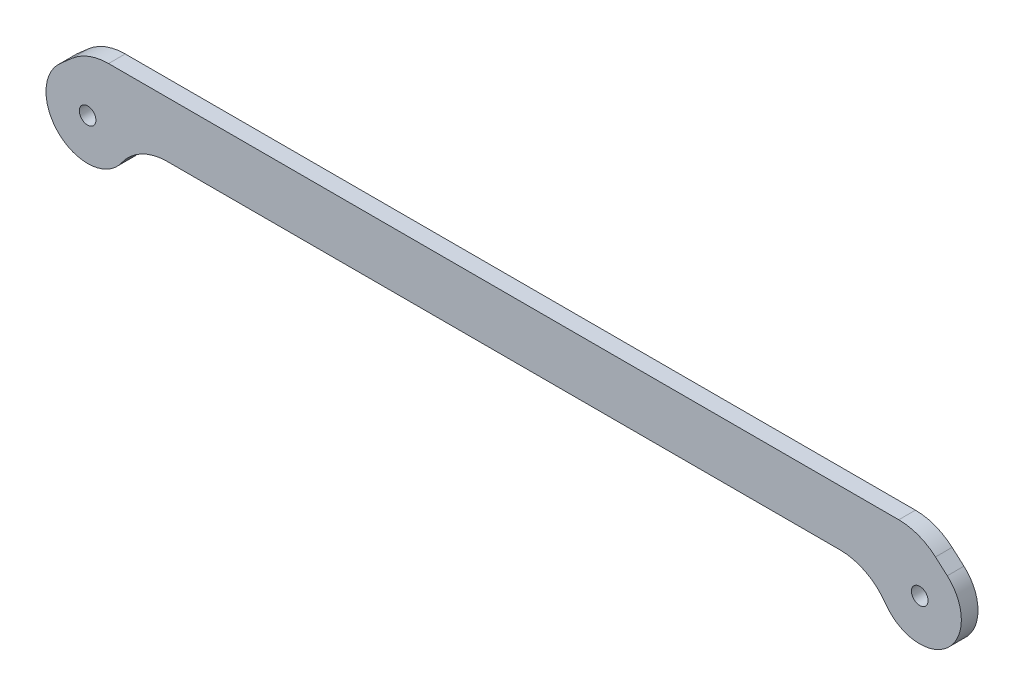
ISO-10303-21;
HEADER;
FILE_DESCRIPTION(('STEP AP214'),'2;1');
FILE_NAME('part.step','',(''),(''),'','','');
FILE_SCHEMA(('AUTOMOTIVE_DESIGN { 1 0 10303 214 1 1 1 1 }'));
ENDSEC;
DATA;
#1=APPLICATION_CONTEXT('core data for automotive mechanical design processes');
#2=APPLICATION_PROTOCOL_DEFINITION('international standard','automotive_design',2000,#1);
#3=PRODUCT_CONTEXT('',#1,'mechanical');
#4=PRODUCT('Part','Part','',(#3));
#5=PRODUCT_RELATED_PRODUCT_CATEGORY('part','',(#4));
#6=PRODUCT_DEFINITION_FORMATION('','',#4);
#7=PRODUCT_DEFINITION_CONTEXT('part definition',#1,'design');
#8=PRODUCT_DEFINITION('design','',#6,#7);
#9=PRODUCT_DEFINITION_SHAPE('','',#8);
#10=(LENGTH_UNIT() NAMED_UNIT(*) SI_UNIT(.MILLI.,.METRE.));
#11=(NAMED_UNIT(*) PLANE_ANGLE_UNIT() SI_UNIT($,.RADIAN.));
#12=(NAMED_UNIT(*) SI_UNIT($,.STERADIAN.) SOLID_ANGLE_UNIT());
#13=UNCERTAINTY_MEASURE_WITH_UNIT(LENGTH_MEASURE(1.E-05),#10,'distance_accuracy_value','');
#14=(GEOMETRIC_REPRESENTATION_CONTEXT(3) GLOBAL_UNCERTAINTY_ASSIGNED_CONTEXT((#13)) GLOBAL_UNIT_ASSIGNED_CONTEXT((#10,
#11,#12)) REPRESENTATION_CONTEXT('',''));
#15=CARTESIAN_POINT('',(0.,0.,0.));
#16=DIRECTION('',(0.,0.,1.));
#17=DIRECTION('',(1.,0.,0.));
#18=AXIS2_PLACEMENT_3D('',#15,#16,#17);
#19=CARTESIAN_POINT('',(0.,0.,3.));
#20=DIRECTION('',(0.,1.,0.));
#21=DIRECTION('',(0.,0.,1.));
#22=AXIS2_PLACEMENT_3D('',#19,#20,#21);
#23=PLANE('',#22);
#24=DIRECTION('',(1.,0.,0.));
#25=VECTOR('',#24,1.);
#26=CARTESIAN_POINT('',(0.,0.,3.));
#27=LINE('',#26,#25);
#28=CARTESIAN_POINT('',(14.3614066163451,0.,3.));
#29=VERTEX_POINT('',#28);
#30=CARTESIAN_POINT('',(135.638593383655,0.,3.));
#31=VERTEX_POINT('',#30);
#32=EDGE_CURVE('E130',#29,#31,#27,.T.);
#33=ORIENTED_EDGE('',*,*,#32,.F.);
#34=DIRECTION('',(0.,0.,1.));
#35=VECTOR('',#34,1.);
#36=CARTESIAN_POINT('',(14.3614066163451,0.,0.));
#37=LINE('',#36,#35);
#38=CARTESIAN_POINT('',(14.3614066163451,0.,0.));
#39=VERTEX_POINT('',#38);
#40=EDGE_CURVE('E199',#29,#39,#37,.F.);
#41=ORIENTED_EDGE('',*,*,#40,.T.);
#42=DIRECTION('',(1.,0.,0.));
#43=VECTOR('',#42,1.);
#44=CARTESIAN_POINT('',(0.,0.,0.));
#45=LINE('',#44,#43);
#46=CARTESIAN_POINT('',(135.638593383655,0.,0.));
#47=VERTEX_POINT('',#46);
#48=EDGE_CURVE('E166',#39,#47,#45,.T.);
#49=ORIENTED_EDGE('',*,*,#48,.T.);
#50=DIRECTION('',(0.,0.,1.));
#51=VECTOR('',#50,1.);
#52=CARTESIAN_POINT('',(135.638593383655,0.,3.));
#53=LINE('',#52,#51);
#54=EDGE_CURVE('E139',#47,#31,#53,.T.);
#55=ORIENTED_EDGE('',*,*,#54,.T.);
#56=EDGE_LOOP('',(#33,#41,#49,#55));
#57=FACE_BOUND('',#56,.T.);
#58=ADVANCED_FACE('F41',(#57),#23,.F.);
#59=CARTESIAN_POINT('',(150.,0.,3.));
#60=DIRECTION('',(0.,0.,-1.));
#61=DIRECTION('',(-1.,0.,0.));
#62=AXIS2_PLACEMENT_3D('',#59,#60,#61);
#63=CYLINDRICAL_SURFACE('',#62,7.50000000000001);
#64=CARTESIAN_POINT('',(150.,0.,3.));
#65=DIRECTION('',(0.,0.,1.));
#66=DIRECTION('',(1.,0.,0.));
#67=AXIS2_PLACEMENT_3D('',#64,#65,#66);
#68=CIRCLE('',#67,7.50000000000001);
#69=CARTESIAN_POINT('',(143.845111450138,-4.28571428571429,3.));
#70=VERTEX_POINT('',#69);
#71=CARTESIAN_POINT('',(154.960783708246,5.62500000000002,3.));
#72=VERTEX_POINT('',#71);
#73=EDGE_CURVE('E119',#70,#72,#68,.T.);
#74=ORIENTED_EDGE('',*,*,#73,.F.);
#75=DIRECTION('',(0.,0.,-1.));
#76=VECTOR('',#75,1.);
#77=CARTESIAN_POINT('',(143.845111450138,-4.28571428571429,3.));
#78=LINE('',#77,#76);
#79=CARTESIAN_POINT('',(143.845111450138,-4.28571428571429,0.));
#80=VERTEX_POINT('',#79);
#81=EDGE_CURVE('E206',#70,#80,#78,.T.);
#82=ORIENTED_EDGE('',*,*,#81,.T.);
#83=CARTESIAN_POINT('',(150.,0.,0.));
#84=DIRECTION('',(0.,0.,1.));
#85=DIRECTION('',(1.,0.,0.));
#86=AXIS2_PLACEMENT_3D('',#83,#84,#85);
#87=CIRCLE('',#86,7.50000000000001);
#88=CARTESIAN_POINT('',(154.960783708246,5.62500000000002,0.));
#89=VERTEX_POINT('',#88);
#90=EDGE_CURVE('E136',#80,#89,#87,.T.);
#91=ORIENTED_EDGE('',*,*,#90,.T.);
#92=DIRECTION('',(0.,0.,-1.));
#93=VECTOR('',#92,1.);
#94=CARTESIAN_POINT('',(154.960783708246,5.62500000000002,3.));
#95=LINE('',#94,#93);
#96=EDGE_CURVE('E133',#72,#89,#95,.T.);
#97=ORIENTED_EDGE('',*,*,#96,.F.);
#98=EDGE_LOOP('',(#74,#82,#91,#97));
#99=FACE_BOUND('',#98,.T.);
#100=ADVANCED_FACE('F134',(#99),#63,.T.);
#101=CARTESIAN_POINT('',(70.5857837082459,80.0367556236916,3.));
#102=DIRECTION('',(-0.661437827766147,-0.750000000000001,0.));
#103=DIRECTION('',(0.750000000000001,-0.661437827766147,0.));
#104=AXIS2_PLACEMENT_3D('',#101,#102,#103);
#105=PLANE('',#104);
#106=DIRECTION('',(-0.750000000000001,0.661437827766147,0.));
#107=VECTOR('',#106,1.);
#108=CARTESIAN_POINT('',(70.5857837082459,80.0367556236916,0.));
#109=LINE('',#108,#107);
#110=CARTESIAN_POINT('',(152.834733547569,7.49999999999999,0.));
#111=VERTEX_POINT('',#110);
#112=EDGE_CURVE('E172',#89,#111,#109,.T.);
#113=ORIENTED_EDGE('',*,*,#112,.T.);
#114=DIRECTION('',(0.,0.,-1.));
#115=VECTOR('',#114,1.);
#116=CARTESIAN_POINT('',(152.834733547569,7.50000000000001,3.));
#117=LINE('',#116,#115);
#118=CARTESIAN_POINT('',(152.834733547569,7.49999999999999,3.));
#119=VERTEX_POINT('',#118);
#120=EDGE_CURVE('E57',#111,#119,#117,.F.);
#121=ORIENTED_EDGE('',*,*,#120,.T.);
#122=DIRECTION('',(-0.750000000000001,0.661437827766147,0.));
#123=VECTOR('',#122,1.);
#124=CARTESIAN_POINT('',(70.5857837082459,80.0367556236916,3.));
#125=LINE('',#124,#123);
#126=EDGE_CURVE('E123',#72,#119,#125,.T.);
#127=ORIENTED_EDGE('',*,*,#126,.F.);
#128=ORIENTED_EDGE('',*,*,#96,.T.);
#129=EDGE_LOOP('',(#113,#121,#127,#128));
#130=FACE_BOUND('',#129,.T.);
#131=ADVANCED_FACE('F142',(#130),#105,.F.);
#132=CARTESIAN_POINT('',(0.,10.,3.));
#133=DIRECTION('',(0.,1.,0.));
#134=DIRECTION('',(0.,0.,1.));
#135=AXIS2_PLACEMENT_3D('',#132,#133,#134);
#136=PLANE('',#135);
#137=DIRECTION('',(1.,0.,0.));
#138=VECTOR('',#137,1.);
#139=CARTESIAN_POINT('',(0.,10.,0.));
#140=LINE('',#139,#138);
#141=CARTESIAN_POINT('',(3.77964473009227,10.,0.));
#142=VERTEX_POINT('',#141);
#143=CARTESIAN_POINT('',(146.220355269908,10.,0.));
#144=VERTEX_POINT('',#143);
#145=EDGE_CURVE('E175',#142,#144,#140,.T.);
#146=ORIENTED_EDGE('',*,*,#145,.F.);
#147=DIRECTION('',(0.,0.,-1.));
#148=VECTOR('',#147,1.);
#149=CARTESIAN_POINT('',(3.77964473009227,10.,3.));
#150=LINE('',#149,#148);
#151=CARTESIAN_POINT('',(3.77964473009227,10.,3.));
#152=VERTEX_POINT('',#151);
#153=EDGE_CURVE('E223',#142,#152,#150,.F.);
#154=ORIENTED_EDGE('',*,*,#153,.T.);
#155=DIRECTION('',(1.,0.,0.));
#156=VECTOR('',#155,1.);
#157=CARTESIAN_POINT('',(0.,10.,3.));
#158=LINE('',#157,#156);
#159=CARTESIAN_POINT('',(146.220355269908,10.,3.));
#160=VERTEX_POINT('',#159);
#161=EDGE_CURVE('E144',#152,#160,#158,.T.);
#162=ORIENTED_EDGE('',*,*,#161,.T.);
#163=DIRECTION('',(0.,0.,-1.));
#164=VECTOR('',#163,1.);
#165=CARTESIAN_POINT('',(146.220355269908,10.,0.));
#166=LINE('',#165,#164);
#167=EDGE_CURVE('E219',#160,#144,#166,.T.);
#168=ORIENTED_EDGE('',*,*,#167,.T.);
#169=EDGE_LOOP('',(#146,#154,#162,#168));
#170=FACE_BOUND('',#169,.T.);
#171=ADVANCED_FACE('F269',(#170),#136,.T.);
#172=CARTESIAN_POINT('',(-4.96078370824611,5.62499999999999,3.));
#173=DIRECTION('',(-0.661437827766148,0.749999999999999,0.));
#174=DIRECTION('',(-0.749999999999999,-0.661437827766148,0.));
#175=AXIS2_PLACEMENT_3D('',#172,#173,#174);
#176=PLANE('',#175);
#177=DIRECTION('',(0.75,0.661437827766148,0.));
#178=VECTOR('',#177,1.);
#179=CARTESIAN_POINT('',(-4.96078370824611,5.62499999999999,3.));
#180=LINE('',#179,#178);
#181=CARTESIAN_POINT('',(-4.96078370824611,5.62499999999999,3.));
#182=VERTEX_POINT('',#181);
#183=CARTESIAN_POINT('',(-2.83473354756921,7.49999999999999,3.));
#184=VERTEX_POINT('',#183);
#185=EDGE_CURVE('E147',#182,#184,#180,.T.);
#186=ORIENTED_EDGE('',*,*,#185,.T.);
#187=DIRECTION('',(0.,0.,-1.));
#188=VECTOR('',#187,1.);
#189=CARTESIAN_POINT('',(-2.83473354756921,7.49999999999999,3.));
#190=LINE('',#189,#188);
#191=CARTESIAN_POINT('',(-2.83473354756921,7.49999999999999,0.));
#192=VERTEX_POINT('',#191);
#193=EDGE_CURVE('E209',#184,#192,#190,.T.);
#194=ORIENTED_EDGE('',*,*,#193,.T.);
#195=DIRECTION('',(0.75,0.661437827766148,0.));
#196=VECTOR('',#195,1.);
#197=CARTESIAN_POINT('',(-4.96078370824611,5.62499999999999,0.));
#198=LINE('',#197,#196);
#199=CARTESIAN_POINT('',(-4.96078370824611,5.62499999999999,0.));
#200=VERTEX_POINT('',#199);
#201=EDGE_CURVE('E179',#200,#192,#198,.T.);
#202=ORIENTED_EDGE('',*,*,#201,.F.);
#203=DIRECTION('',(0.,0.,-1.));
#204=VECTOR('',#203,1.);
#205=CARTESIAN_POINT('',(-4.96078370824611,5.62499999999999,3.));
#206=LINE('',#205,#204);
#207=EDGE_CURVE('E140',#182,#200,#206,.T.);
#208=ORIENTED_EDGE('',*,*,#207,.F.);
#209=EDGE_LOOP('',(#186,#194,#202,#208));
#210=FACE_BOUND('',#209,.T.);
#211=ADVANCED_FACE('F272',(#210),#176,.T.);
#212=CARTESIAN_POINT('',(0.,0.,3.));
#213=DIRECTION('',(0.,0.,-1.));
#214=DIRECTION('',(-1.,0.,0.));
#215=AXIS2_PLACEMENT_3D('',#212,#213,#214);
#216=CYLINDRICAL_SURFACE('',#215,1.5);
#217=CARTESIAN_POINT('',(0.,0.,3.));
#218=DIRECTION('',(0.,0.,1.));
#219=DIRECTION('',(1.,0.,0.));
#220=AXIS2_PLACEMENT_3D('',#217,#218,#219);
#221=CIRCLE('',#220,1.5);
#222=CARTESIAN_POINT('',(1.5,0.,3.));
#223=VERTEX_POINT('',#222);
#224=EDGE_CURVE('E158',#223,#223,#221,.T.);
#225=ORIENTED_EDGE('',*,*,#224,.T.);
#226=EDGE_LOOP('',(#225));
#227=FACE_BOUND('',#226,.T.);
#228=CARTESIAN_POINT('',(0.,0.,0.));
#229=DIRECTION('',(0.,0.,1.));
#230=DIRECTION('',(1.,0.,0.));
#231=AXIS2_PLACEMENT_3D('',#228,#229,#230);
#232=CIRCLE('',#231,1.5);
#233=CARTESIAN_POINT('',(1.5,0.,0.));
#234=VERTEX_POINT('',#233);
#235=EDGE_CURVE('E187',#234,#234,#232,.T.);
#236=ORIENTED_EDGE('',*,*,#235,.F.);
#237=EDGE_LOOP('',(#236));
#238=FACE_BOUND('',#237,.T.);
#239=ADVANCED_FACE('F276',(#227,#238),#216,.F.);
#240=CARTESIAN_POINT('',(0.,0.,3.));
#241=DIRECTION('',(0.,0.,-1.));
#242=DIRECTION('',(-1.,0.,0.));
#243=AXIS2_PLACEMENT_3D('',#240,#241,#242);
#244=CYLINDRICAL_SURFACE('',#243,7.49999999999999);
#245=CARTESIAN_POINT('',(0.,0.,0.));
#246=DIRECTION('',(0.,0.,1.));
#247=DIRECTION('',(1.,0.,0.));
#248=AXIS2_PLACEMENT_3D('',#245,#246,#247);
#249=CIRCLE('',#248,7.49999999999999);
#250=CARTESIAN_POINT('',(6.15488854986217,-4.28571428571428,0.));
#251=VERTEX_POINT('',#250);
#252=EDGE_CURVE('E183',#200,#251,#249,.T.);
#253=ORIENTED_EDGE('',*,*,#252,.T.);
#254=DIRECTION('',(0.,0.,-1.));
#255=VECTOR('',#254,1.);
#256=CARTESIAN_POINT('',(6.15488854986217,-4.28571428571428,3.));
#257=LINE('',#256,#255);
#258=CARTESIAN_POINT('',(6.15488854986217,-4.28571428571428,3.));
#259=VERTEX_POINT('',#258);
#260=EDGE_CURVE('E203',#251,#259,#257,.F.);
#261=ORIENTED_EDGE('',*,*,#260,.T.);
#262=CARTESIAN_POINT('',(0.,0.,3.));
#263=DIRECTION('',(0.,0.,1.));
#264=DIRECTION('',(1.,0.,0.));
#265=AXIS2_PLACEMENT_3D('',#262,#263,#264);
#266=CIRCLE('',#265,7.49999999999999);
#267=EDGE_CURVE('E154',#182,#259,#266,.T.);
#268=ORIENTED_EDGE('',*,*,#267,.F.);
#269=ORIENTED_EDGE('',*,*,#207,.T.);
#270=EDGE_LOOP('',(#253,#261,#268,#269));
#271=FACE_BOUND('',#270,.T.);
#272=ADVANCED_FACE('F278',(#271),#244,.T.);
#273=CARTESIAN_POINT('',(150.,0.,3.));
#274=DIRECTION('',(0.,0.,-1.));
#275=DIRECTION('',(-1.,0.,0.));
#276=AXIS2_PLACEMENT_3D('',#273,#274,#275);
#277=CYLINDRICAL_SURFACE('',#276,1.5);
#278=CARTESIAN_POINT('',(150.,0.,3.));
#279=DIRECTION('',(0.,0.,1.));
#280=DIRECTION('',(1.,0.,0.));
#281=AXIS2_PLACEMENT_3D('',#278,#279,#280);
#282=CIRCLE('',#281,1.5);
#283=CARTESIAN_POINT('',(151.5,0.,3.));
#284=VERTEX_POINT('',#283);
#285=EDGE_CURVE('E162',#284,#284,#282,.T.);
#286=ORIENTED_EDGE('',*,*,#285,.T.);
#287=EDGE_LOOP('',(#286));
#288=FACE_BOUND('',#287,.T.);
#289=CARTESIAN_POINT('',(150.,0.,0.));
#290=DIRECTION('',(0.,0.,1.));
#291=DIRECTION('',(1.,0.,0.));
#292=AXIS2_PLACEMENT_3D('',#289,#290,#291);
#293=CIRCLE('',#292,1.5);
#294=CARTESIAN_POINT('',(151.5,0.,0.));
#295=VERTEX_POINT('',#294);
#296=EDGE_CURVE('E191',#295,#295,#293,.T.);
#297=ORIENTED_EDGE('',*,*,#296,.F.);
#298=EDGE_LOOP('',(#297));
#299=FACE_BOUND('',#298,.T.);
#300=ADVANCED_FACE('F281',(#288,#299),#277,.F.);
#301=CARTESIAN_POINT('',(0.,0.,3.));
#302=DIRECTION('',(0.,0.,1.));
#303=DIRECTION('',(1.,0.,0.));
#304=AXIS2_PLACEMENT_3D('',#301,#302,#303);
#305=PLANE('',#304);
#306=ORIENTED_EDGE('',*,*,#161,.F.);
#307=CARTESIAN_POINT('',(3.77964473009227,0.,3.));
#308=DIRECTION('',(0.,0.,1.));
#309=DIRECTION('',(1.,0.,0.));
#310=AXIS2_PLACEMENT_3D('',#307,#308,#309);
#311=CIRCLE('',#310,10.);
#312=EDGE_CURVE('E228',#152,#184,#311,.T.);
#313=ORIENTED_EDGE('',*,*,#312,.T.);
#314=ORIENTED_EDGE('',*,*,#185,.F.);
#315=ORIENTED_EDGE('',*,*,#267,.T.);
#316=CARTESIAN_POINT('',(14.3614066163451,-10.,3.));
#317=DIRECTION('',(0.,0.,1.));
#318=DIRECTION('',(1.,0.,0.));
#319=AXIS2_PLACEMENT_3D('',#316,#317,#318);
#320=CIRCLE('',#319,10.);
#321=EDGE_CURVE('E236',#259,#29,#320,.F.);
#322=ORIENTED_EDGE('',*,*,#321,.T.);
#323=ORIENTED_EDGE('',*,*,#32,.T.);
#324=CARTESIAN_POINT('',(135.638593383655,-10.,3.));
#325=DIRECTION('',(0.,0.,1.));
#326=DIRECTION('',(1.,0.,0.));
#327=AXIS2_PLACEMENT_3D('',#324,#325,#326);
#328=CIRCLE('',#327,10.);
#329=EDGE_CURVE('E11',#31,#70,#328,.F.);
#330=ORIENTED_EDGE('',*,*,#329,.T.);
#331=ORIENTED_EDGE('',*,*,#73,.T.);
#332=ORIENTED_EDGE('',*,*,#126,.T.);
#333=CARTESIAN_POINT('',(146.220355269908,0.,3.));
#334=DIRECTION('',(0.,0.,1.));
#335=DIRECTION('',(1.,0.,0.));
#336=AXIS2_PLACEMENT_3D('',#333,#334,#335);
#337=CIRCLE('',#336,10.);
#338=EDGE_CURVE('E64',#119,#160,#337,.T.);
#339=ORIENTED_EDGE('',*,*,#338,.T.);
#340=EDGE_LOOP('',(#306,#313,#314,#315,#322,#323,#330,#331,#332,#339));
#341=FACE_BOUND('',#340,.T.);
#342=ORIENTED_EDGE('',*,*,#224,.F.);
#343=EDGE_LOOP('',(#342));
#344=FACE_BOUND('',#343,.T.);
#345=ORIENTED_EDGE('',*,*,#285,.F.);
#346=EDGE_LOOP('',(#345));
#347=FACE_BOUND('',#346,.T.);
#348=ADVANCED_FACE('F121',(#341,#344,#347),#305,.T.);
#349=CARTESIAN_POINT('',(0.,0.,0.));
#350=DIRECTION('',(0.,0.,1.));
#351=DIRECTION('',(1.,0.,0.));
#352=AXIS2_PLACEMENT_3D('',#349,#350,#351);
#353=PLANE('',#352);
#354=ORIENTED_EDGE('',*,*,#201,.T.);
#355=CARTESIAN_POINT('',(3.77964473009227,0.,0.));
#356=DIRECTION('',(0.,0.,1.));
#357=DIRECTION('',(1.,0.,0.));
#358=AXIS2_PLACEMENT_3D('',#355,#356,#357);
#359=CIRCLE('',#358,10.);
#360=EDGE_CURVE('E216',#192,#142,#359,.F.);
#361=ORIENTED_EDGE('',*,*,#360,.T.);
#362=ORIENTED_EDGE('',*,*,#145,.T.);
#363=CARTESIAN_POINT('',(146.220355269908,0.,0.));
#364=DIRECTION('',(0.,0.,1.));
#365=DIRECTION('',(1.,0.,0.));
#366=AXIS2_PLACEMENT_3D('',#363,#364,#365);
#367=CIRCLE('',#366,10.);
#368=EDGE_CURVE('E213',#144,#111,#367,.F.);
#369=ORIENTED_EDGE('',*,*,#368,.T.);
#370=ORIENTED_EDGE('',*,*,#112,.F.);
#371=ORIENTED_EDGE('',*,*,#90,.F.);
#372=CARTESIAN_POINT('',(135.638593383655,-10.,0.));
#373=DIRECTION('',(0.,0.,1.));
#374=DIRECTION('',(1.,0.,0.));
#375=AXIS2_PLACEMENT_3D('',#372,#373,#374);
#376=CIRCLE('',#375,10.);
#377=EDGE_CURVE('E50',#80,#47,#376,.T.);
#378=ORIENTED_EDGE('',*,*,#377,.T.);
#379=ORIENTED_EDGE('',*,*,#48,.F.);
#380=CARTESIAN_POINT('',(14.3614066163451,-10.,0.));
#381=DIRECTION('',(0.,0.,1.));
#382=DIRECTION('',(1.,0.,0.));
#383=AXIS2_PLACEMENT_3D('',#380,#381,#382);
#384=CIRCLE('',#383,10.);
#385=EDGE_CURVE('E233',#39,#251,#384,.T.);
#386=ORIENTED_EDGE('',*,*,#385,.T.);
#387=ORIENTED_EDGE('',*,*,#252,.F.);
#388=EDGE_LOOP('',(#354,#361,#362,#369,#370,#371,#378,#379,#386,#387));
#389=FACE_BOUND('',#388,.T.);
#390=ORIENTED_EDGE('',*,*,#235,.T.);
#391=EDGE_LOOP('',(#390));
#392=FACE_BOUND('',#391,.T.);
#393=ORIENTED_EDGE('',*,*,#296,.T.);
#394=EDGE_LOOP('',(#393));
#395=FACE_BOUND('',#394,.T.);
#396=ADVANCED_FACE('F241',(#389,#392,#395),#353,.F.);
#397=CARTESIAN_POINT('',(14.3614066163451,-10.,3.));
#398=DIRECTION('',(0.,0.,-1.));
#399=DIRECTION('',(-1.,0.,0.));
#400=AXIS2_PLACEMENT_3D('',#397,#398,#399);
#401=CYLINDRICAL_SURFACE('',#400,10.);
#402=ORIENTED_EDGE('',*,*,#321,.F.);
#403=ORIENTED_EDGE('',*,*,#260,.F.);
#404=ORIENTED_EDGE('',*,*,#385,.F.);
#405=ORIENTED_EDGE('',*,*,#40,.F.);
#406=EDGE_LOOP('',(#402,#403,#404,#405));
#407=FACE_BOUND('',#406,.T.);
#408=ADVANCED_FACE('F251',(#407),#401,.F.);
#409=CARTESIAN_POINT('',(135.638593383655,-10.,3.));
#410=DIRECTION('',(0.,0.,-1.));
#411=DIRECTION('',(-1.,0.,0.));
#412=AXIS2_PLACEMENT_3D('',#409,#410,#411);
#413=CYLINDRICAL_SURFACE('',#412,10.);
#414=ORIENTED_EDGE('',*,*,#329,.F.);
#415=ORIENTED_EDGE('',*,*,#54,.F.);
#416=ORIENTED_EDGE('',*,*,#377,.F.);
#417=ORIENTED_EDGE('',*,*,#81,.F.);
#418=EDGE_LOOP('',(#414,#415,#416,#417));
#419=FACE_BOUND('',#418,.T.);
#420=ADVANCED_FACE('F248',(#419),#413,.F.);
#421=CARTESIAN_POINT('',(3.77964473009227,0.,3.));
#422=DIRECTION('',(0.,0.,-1.));
#423=DIRECTION('',(-1.,0.,0.));
#424=AXIS2_PLACEMENT_3D('',#421,#422,#423);
#425=CYLINDRICAL_SURFACE('',#424,10.);
#426=ORIENTED_EDGE('',*,*,#312,.F.);
#427=ORIENTED_EDGE('',*,*,#153,.F.);
#428=ORIENTED_EDGE('',*,*,#360,.F.);
#429=ORIENTED_EDGE('',*,*,#193,.F.);
#430=EDGE_LOOP('',(#426,#427,#428,#429));
#431=FACE_BOUND('',#430,.T.);
#432=ADVANCED_FACE('F250',(#431),#425,.T.);
#433=CARTESIAN_POINT('',(146.220355269908,0.,3.));
#434=DIRECTION('',(0.,0.,1.));
#435=DIRECTION('',(1.,0.,0.));
#436=AXIS2_PLACEMENT_3D('',#433,#434,#435);
#437=CYLINDRICAL_SURFACE('',#436,10.);
#438=ORIENTED_EDGE('',*,*,#338,.F.);
#439=ORIENTED_EDGE('',*,*,#120,.F.);
#440=ORIENTED_EDGE('',*,*,#368,.F.);
#441=ORIENTED_EDGE('',*,*,#167,.F.);
#442=EDGE_LOOP('',(#438,#439,#440,#441));
#443=FACE_BOUND('',#442,.T.);
#444=ADVANCED_FACE('F43',(#443),#437,.T.);
#445=CLOSED_SHELL('',(#58,#100,#131,#171,#211,#239,#272,#300,#348,#396,#408,#420,#432,#444));
#446=MANIFOLD_SOLID_BREP('B2',#445);
#447=ADVANCED_BREP_SHAPE_REPRESENTATION('',(#18,#446),#14);
#448=SHAPE_DEFINITION_REPRESENTATION(#9,#447);
ENDSEC;
END-ISO-10303-21;
